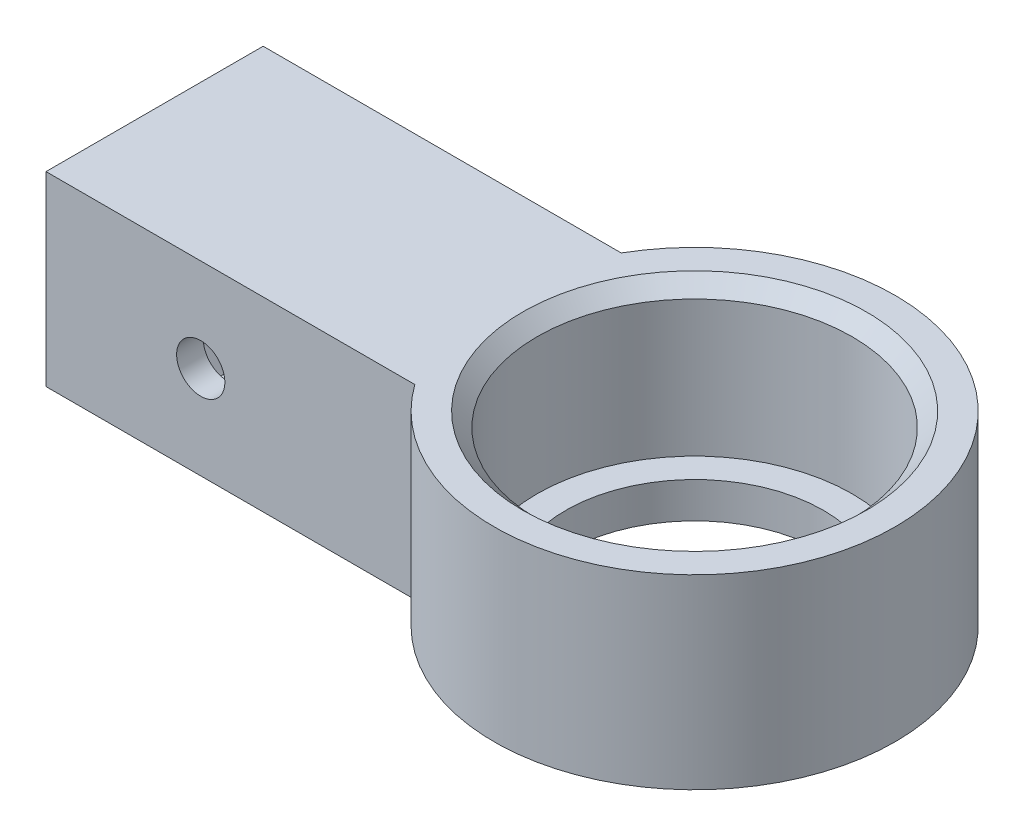
ISO-10303-21;
HEADER;
FILE_DESCRIPTION(('STEP AP214'),'2;1');
FILE_NAME('part.step','',(''),(''),'','','');
FILE_SCHEMA(('AUTOMOTIVE_DESIGN { 1 0 10303 214 1 1 1 1 }'));
ENDSEC;
DATA;
#1=APPLICATION_CONTEXT('core data for automotive mechanical design processes');
#2=APPLICATION_PROTOCOL_DEFINITION('international standard','automotive_design',2000,#1);
#3=PRODUCT_CONTEXT('',#1,'mechanical');
#4=PRODUCT('Part','Part','',(#3));
#5=PRODUCT_RELATED_PRODUCT_CATEGORY('part','',(#4));
#6=PRODUCT_DEFINITION_FORMATION('','',#4);
#7=PRODUCT_DEFINITION_CONTEXT('part definition',#1,'design');
#8=PRODUCT_DEFINITION('design','',#6,#7);
#9=PRODUCT_DEFINITION_SHAPE('','',#8);
#10=(LENGTH_UNIT() NAMED_UNIT(*) SI_UNIT(.MILLI.,.METRE.));
#11=(NAMED_UNIT(*) PLANE_ANGLE_UNIT() SI_UNIT($,.RADIAN.));
#12=(NAMED_UNIT(*) SI_UNIT($,.STERADIAN.) SOLID_ANGLE_UNIT());
#13=UNCERTAINTY_MEASURE_WITH_UNIT(LENGTH_MEASURE(1.E-05),#10,'distance_accuracy_value','');
#14=(GEOMETRIC_REPRESENTATION_CONTEXT(3) GLOBAL_UNCERTAINTY_ASSIGNED_CONTEXT((#13)) GLOBAL_UNIT_ASSIGNED_CONTEXT((#10,
#11,#12)) REPRESENTATION_CONTEXT('',''));
#15=CARTESIAN_POINT('',(0.,0.,0.));
#16=DIRECTION('',(0.,0.,1.));
#17=DIRECTION('',(1.,0.,0.));
#18=AXIS2_PLACEMENT_3D('',#15,#16,#17);
#19=CARTESIAN_POINT('',(0.,13.,0.));
#20=DIRECTION('',(0.,-1.,0.));
#21=DIRECTION('',(0.,0.,-1.));
#22=AXIS2_PLACEMENT_3D('',#19,#20,#21);
#23=CYLINDRICAL_SURFACE('',#22,11.);
#24=CARTESIAN_POINT('',(0.,12.,0.));
#25=DIRECTION('',(0.,1.,0.));
#26=DIRECTION('',(0.,0.,1.));
#27=AXIS2_PLACEMENT_3D('',#24,#25,#26);
#28=CIRCLE('',#27,11.);
#29=CARTESIAN_POINT('',(0.,12.,11.));
#30=VERTEX_POINT('',#29);
#31=EDGE_CURVE('E41',#30,#30,#28,.T.);
#32=ORIENTED_EDGE('',*,*,#31,.T.);
#33=EDGE_LOOP('',(#32));
#34=FACE_BOUND('',#33,.T.);
#35=CARTESIAN_POINT('',(0.,2.5,0.));
#36=DIRECTION('',(0.,-1.,0.));
#37=DIRECTION('',(0.,0.,-1.));
#38=AXIS2_PLACEMENT_3D('',#35,#36,#37);
#39=CIRCLE('',#38,11.);
#40=CARTESIAN_POINT('',(0.,2.5,-11.));
#41=VERTEX_POINT('',#40);
#42=EDGE_CURVE('E320',#41,#41,#39,.T.);
#43=ORIENTED_EDGE('',*,*,#42,.T.);
#44=EDGE_LOOP('',(#43));
#45=FACE_BOUND('',#44,.T.);
#46=ADVANCED_FACE('F33',(#34,#45),#23,.F.);
#47=CARTESIAN_POINT('',(0.,13.,0.));
#48=DIRECTION('',(0.,1.,0.));
#49=DIRECTION('',(0.,0.,1.));
#50=AXIS2_PLACEMENT_3D('',#47,#48,#49);
#51=PLANE('',#50);
#52=CARTESIAN_POINT('',(0.,13.,0.));
#53=DIRECTION('',(0.,1.,0.));
#54=DIRECTION('',(0.,0.,1.));
#55=AXIS2_PLACEMENT_3D('',#52,#53,#54);
#56=CIRCLE('',#55,12.);
#57=CARTESIAN_POINT('',(0.,13.,12.));
#58=VERTEX_POINT('',#57);
#59=EDGE_CURVE('E11',#58,#58,#56,.F.);
#60=ORIENTED_EDGE('',*,*,#59,.T.);
#61=EDGE_LOOP('',(#60));
#62=FACE_BOUND('',#61,.T.);
#63=CARTESIAN_POINT('',(0.,13.,0.));
#64=DIRECTION('',(0.,1.,0.));
#65=DIRECTION('',(0.,0.,1.));
#66=AXIS2_PLACEMENT_3D('',#63,#64,#65);
#67=CIRCLE('',#66,14.);
#68=CARTESIAN_POINT('',(-11.375302548228,13.,8.16103497947882));
#69=VERTEX_POINT('',#68);
#70=CARTESIAN_POINT('',(-12.1243556529821,13.,-7.));
#71=VERTEX_POINT('',#70);
#72=EDGE_CURVE('E222',#69,#71,#67,.T.);
#73=ORIENTED_EDGE('',*,*,#72,.T.);
#74=DIRECTION('',(-1.,0.,0.));
#75=VECTOR('',#74,1.);
#76=CARTESIAN_POINT('',(-12.1243556529821,13.,-7.));
#77=LINE('',#76,#75);
#78=CARTESIAN_POINT('',(-37.1243556529821,13.,-7.));
#79=VERTEX_POINT('',#78);
#80=EDGE_CURVE('E225',#71,#79,#77,.T.);
#81=ORIENTED_EDGE('',*,*,#80,.T.);
#82=DIRECTION('',(0.,0.,1.));
#83=VECTOR('',#82,1.);
#84=CARTESIAN_POINT('',(-37.1243556529821,13.,8.16103497947882));
#85=LINE('',#84,#83);
#86=CARTESIAN_POINT('',(-37.1243556529821,13.,8.16103497947882));
#87=VERTEX_POINT('',#86);
#88=EDGE_CURVE('E228',#79,#87,#85,.T.);
#89=ORIENTED_EDGE('',*,*,#88,.T.);
#90=DIRECTION('',(1.,0.,0.));
#91=VECTOR('',#90,1.);
#92=CARTESIAN_POINT('',(-37.1243556529821,13.,8.16103497947882));
#93=LINE('',#92,#91);
#94=EDGE_CURVE('E230',#87,#69,#93,.T.);
#95=ORIENTED_EDGE('',*,*,#94,.T.);
#96=EDGE_LOOP('',(#73,#81,#89,#95));
#97=FACE_BOUND('',#96,.T.);
#98=ADVANCED_FACE('F266',(#62,#97),#51,.T.);
#99=CARTESIAN_POINT('',(0.,0.,0.));
#100=DIRECTION('',(0.,1.,0.));
#101=DIRECTION('',(0.,0.,1.));
#102=AXIS2_PLACEMENT_3D('',#99,#100,#101);
#103=PLANE('',#102);
#104=CARTESIAN_POINT('',(0.,0.,0.));
#105=DIRECTION('',(0.,1.,0.));
#106=DIRECTION('',(0.,0.,1.));
#107=AXIS2_PLACEMENT_3D('',#104,#105,#106);
#108=CIRCLE('',#107,14.);
#109=CARTESIAN_POINT('',(-11.375302548228,0.,8.16103497947882));
#110=VERTEX_POINT('',#109);
#111=CARTESIAN_POINT('',(-12.1243556529821,0.,-7.));
#112=VERTEX_POINT('',#111);
#113=EDGE_CURVE('E216',#110,#112,#108,.T.);
#114=ORIENTED_EDGE('',*,*,#113,.F.);
#115=DIRECTION('',(1.,0.,0.));
#116=VECTOR('',#115,1.);
#117=CARTESIAN_POINT('',(-37.1243556529821,0.,8.16103497947882));
#118=LINE('',#117,#116);
#119=CARTESIAN_POINT('',(-37.1243556529821,0.,8.16103497947882));
#120=VERTEX_POINT('',#119);
#121=EDGE_CURVE('E226',#120,#110,#118,.T.);
#122=ORIENTED_EDGE('',*,*,#121,.F.);
#123=DIRECTION('',(0.,0.,1.));
#124=VECTOR('',#123,1.);
#125=CARTESIAN_POINT('',(-37.1243556529821,0.,8.16103497947882));
#126=LINE('',#125,#124);
#127=CARTESIAN_POINT('',(-37.1243556529821,0.,-7.));
#128=VERTEX_POINT('',#127);
#129=EDGE_CURVE('E237',#128,#120,#126,.T.);
#130=ORIENTED_EDGE('',*,*,#129,.F.);
#131=DIRECTION('',(-1.,0.,0.));
#132=VECTOR('',#131,1.);
#133=CARTESIAN_POINT('',(-12.1243556529821,0.,-7.));
#134=LINE('',#133,#132);
#135=EDGE_CURVE('E235',#112,#128,#134,.T.);
#136=ORIENTED_EDGE('',*,*,#135,.F.);
#137=EDGE_LOOP('',(#114,#122,#130,#136));
#138=FACE_BOUND('',#137,.T.);
#139=CARTESIAN_POINT('',(0.,0.,0.));
#140=DIRECTION('',(0.,-1.,0.));
#141=DIRECTION('',(0.,0.,-1.));
#142=AXIS2_PLACEMENT_3D('',#139,#140,#141);
#143=CIRCLE('',#142,9.);
#144=CARTESIAN_POINT('',(0.,0.,-9.));
#145=VERTEX_POINT('',#144);
#146=EDGE_CURVE('E315',#145,#145,#143,.T.);
#147=ORIENTED_EDGE('',*,*,#146,.F.);
#148=EDGE_LOOP('',(#147));
#149=FACE_BOUND('',#148,.T.);
#150=ADVANCED_FACE('F272',(#138,#149),#103,.F.);
#151=CARTESIAN_POINT('',(0.,13.,0.));
#152=DIRECTION('',(0.,-1.,0.));
#153=DIRECTION('',(0.,0.,-1.));
#154=AXIS2_PLACEMENT_3D('',#151,#152,#153);
#155=CYLINDRICAL_SURFACE('',#154,14.);
#156=ORIENTED_EDGE('',*,*,#113,.T.);
#157=DIRECTION('',(0.,-1.,0.));
#158=VECTOR('',#157,1.);
#159=CARTESIAN_POINT('',(-12.1243556529821,13.,-7.));
#160=LINE('',#159,#158);
#161=EDGE_CURVE('E248',#71,#112,#160,.T.);
#162=ORIENTED_EDGE('',*,*,#161,.F.);
#163=ORIENTED_EDGE('',*,*,#72,.F.);
#164=DIRECTION('',(0.,-1.,0.));
#165=VECTOR('',#164,1.);
#166=CARTESIAN_POINT('',(-11.375302548228,13.,8.16103497947882));
#167=LINE('',#166,#165);
#168=EDGE_CURVE('E232',#69,#110,#167,.T.);
#169=ORIENTED_EDGE('',*,*,#168,.T.);
#170=EDGE_LOOP('',(#156,#162,#163,#169));
#171=FACE_BOUND('',#170,.T.);
#172=ADVANCED_FACE('F281',(#171),#155,.T.);
#173=CARTESIAN_POINT('',(-12.1243556529821,13.,-7.));
#174=DIRECTION('',(0.,0.,1.));
#175=DIRECTION('',(1.,0.,0.));
#176=AXIS2_PLACEMENT_3D('',#173,#174,#175);
#177=PLANE('',#176);
#178=ORIENTED_EDGE('',*,*,#135,.T.);
#179=DIRECTION('',(0.,-1.,0.));
#180=VECTOR('',#179,1.);
#181=CARTESIAN_POINT('',(-37.1243556529821,13.,-7.));
#182=LINE('',#181,#180);
#183=EDGE_CURVE('E245',#79,#128,#182,.T.);
#184=ORIENTED_EDGE('',*,*,#183,.F.);
#185=ORIENTED_EDGE('',*,*,#80,.F.);
#186=ORIENTED_EDGE('',*,*,#161,.T.);
#187=EDGE_LOOP('',(#178,#184,#185,#186));
#188=FACE_BOUND('',#187,.T.);
#189=ADVANCED_FACE('F290',(#188),#177,.F.);
#190=CARTESIAN_POINT('',(-37.1243556529821,13.,8.16103497947882));
#191=DIRECTION('',(1.,0.,0.));
#192=DIRECTION('',(0.,0.,-1.));
#193=AXIS2_PLACEMENT_3D('',#190,#191,#192);
#194=PLANE('',#193);
#195=DIRECTION('',(0.,0.,1.));
#196=VECTOR('',#195,1.);
#197=CARTESIAN_POINT('',(-37.1243556529821,3.,3.5));
#198=LINE('',#197,#196);
#199=CARTESIAN_POINT('',(-37.1243556529821,3.,-3.5));
#200=VERTEX_POINT('',#199);
#201=CARTESIAN_POINT('',(-37.1243556529821,3.,3.5));
#202=VERTEX_POINT('',#201);
#203=EDGE_CURVE('E206',#200,#202,#198,.T.);
#204=ORIENTED_EDGE('',*,*,#203,.F.);
#205=DIRECTION('',(0.,-1.,0.));
#206=VECTOR('',#205,1.);
#207=CARTESIAN_POINT('',(-37.1243556529821,3.,-3.5));
#208=LINE('',#207,#206);
#209=CARTESIAN_POINT('',(-37.1243556529821,10.,-3.5));
#210=VERTEX_POINT('',#209);
#211=EDGE_CURVE('E56',#210,#200,#208,.T.);
#212=ORIENTED_EDGE('',*,*,#211,.F.);
#213=DIRECTION('',(0.,0.,-1.));
#214=VECTOR('',#213,1.);
#215=CARTESIAN_POINT('',(-37.1243556529821,10.,3.5));
#216=LINE('',#215,#214);
#217=CARTESIAN_POINT('',(-37.1243556529821,10.,3.5));
#218=VERTEX_POINT('',#217);
#219=EDGE_CURVE('E195',#218,#210,#216,.T.);
#220=ORIENTED_EDGE('',*,*,#219,.F.);
#221=DIRECTION('',(0.,1.,0.));
#222=VECTOR('',#221,1.);
#223=CARTESIAN_POINT('',(-37.1243556529821,3.,3.5));
#224=LINE('',#223,#222);
#225=EDGE_CURVE('E209',#202,#218,#224,.T.);
#226=ORIENTED_EDGE('',*,*,#225,.F.);
#227=EDGE_LOOP('',(#204,#212,#220,#226));
#228=FACE_BOUND('',#227,.T.);
#229=ORIENTED_EDGE('',*,*,#129,.T.);
#230=DIRECTION('',(0.,-1.,0.));
#231=VECTOR('',#230,1.);
#232=CARTESIAN_POINT('',(-37.1243556529821,13.,8.16103497947882));
#233=LINE('',#232,#231);
#234=EDGE_CURVE('E242',#87,#120,#233,.T.);
#235=ORIENTED_EDGE('',*,*,#234,.F.);
#236=ORIENTED_EDGE('',*,*,#88,.F.);
#237=ORIENTED_EDGE('',*,*,#183,.T.);
#238=EDGE_LOOP('',(#229,#235,#236,#237));
#239=FACE_BOUND('',#238,.T.);
#240=ADVANCED_FACE('F286',(#228,#239),#194,.F.);
#241=CARTESIAN_POINT('',(-37.1243556529821,13.,8.16103497947882));
#242=DIRECTION('',(0.,0.,-1.));
#243=DIRECTION('',(-1.,0.,0.));
#244=AXIS2_PLACEMENT_3D('',#241,#242,#243);
#245=PLANE('',#244);
#246=CARTESIAN_POINT('',(-26.3212409424091,6.5,8.16103497947882));
#247=DIRECTION('',(0.,0.,-1.));
#248=DIRECTION('',(-1.,0.,0.));
#249=AXIS2_PLACEMENT_3D('',#246,#247,#248);
#250=CIRCLE('',#249,1.68366195753649);
#251=CARTESIAN_POINT('',(-28.0049028999456,6.5,8.16103497947882));
#252=VERTEX_POINT('',#251);
#253=EDGE_CURVE('E161',#252,#252,#250,.T.);
#254=ORIENTED_EDGE('',*,*,#253,.T.);
#255=EDGE_LOOP('',(#254));
#256=FACE_BOUND('',#255,.T.);
#257=ORIENTED_EDGE('',*,*,#121,.T.);
#258=ORIENTED_EDGE('',*,*,#168,.F.);
#259=ORIENTED_EDGE('',*,*,#94,.F.);
#260=ORIENTED_EDGE('',*,*,#234,.T.);
#261=EDGE_LOOP('',(#257,#258,#259,#260));
#262=FACE_BOUND('',#261,.T.);
#263=ADVANCED_FACE('F283',(#256,#262),#245,.F.);
#264=CARTESIAN_POINT('',(-11.1243556529821,3.,-3.5));
#265=DIRECTION('',(0.,0.,-1.));
#266=DIRECTION('',(-1.,0.,0.));
#267=AXIS2_PLACEMENT_3D('',#264,#265,#266);
#268=PLANE('',#267);
#269=ORIENTED_EDGE('',*,*,#211,.T.);
#270=DIRECTION('',(-1.,0.,0.));
#271=VECTOR('',#270,1.);
#272=CARTESIAN_POINT('',(-11.1243556529821,3.,-3.5));
#273=LINE('',#272,#271);
#274=CARTESIAN_POINT('',(-11.1243556529821,3.,-3.5));
#275=VERTEX_POINT('',#274);
#276=EDGE_CURVE('E204',#275,#200,#273,.T.);
#277=ORIENTED_EDGE('',*,*,#276,.F.);
#278=DIRECTION('',(0.,-1.,0.));
#279=VECTOR('',#278,1.);
#280=CARTESIAN_POINT('',(-11.1243556529821,3.,-3.5));
#281=LINE('',#280,#279);
#282=CARTESIAN_POINT('',(-11.1243556529821,10.,-3.5));
#283=VERTEX_POINT('',#282);
#284=EDGE_CURVE('E191',#283,#275,#281,.T.);
#285=ORIENTED_EDGE('',*,*,#284,.F.);
#286=DIRECTION('',(-1.,0.,0.));
#287=VECTOR('',#286,1.);
#288=CARTESIAN_POINT('',(-11.1243556529821,10.,-3.5));
#289=LINE('',#288,#287);
#290=EDGE_CURVE('E214',#283,#210,#289,.T.);
#291=ORIENTED_EDGE('',*,*,#290,.T.);
#292=EDGE_LOOP('',(#269,#277,#285,#291));
#293=FACE_BOUND('',#292,.T.);
#294=ADVANCED_FACE('F276',(#293),#268,.F.);
#295=CARTESIAN_POINT('',(-11.1243556529821,10.,3.5));
#296=DIRECTION('',(0.,1.,0.));
#297=DIRECTION('',(0.,0.,1.));
#298=AXIS2_PLACEMENT_3D('',#295,#296,#297);
#299=PLANE('',#298);
#300=ORIENTED_EDGE('',*,*,#219,.T.);
#301=ORIENTED_EDGE('',*,*,#290,.F.);
#302=DIRECTION('',(0.,0.,-1.));
#303=VECTOR('',#302,1.);
#304=CARTESIAN_POINT('',(-11.1243556529821,10.,3.5));
#305=LINE('',#304,#303);
#306=CARTESIAN_POINT('',(-11.1243556529821,10.,3.5));
#307=VERTEX_POINT('',#306);
#308=EDGE_CURVE('E201',#307,#283,#305,.T.);
#309=ORIENTED_EDGE('',*,*,#308,.F.);
#310=DIRECTION('',(-1.,0.,0.));
#311=VECTOR('',#310,1.);
#312=CARTESIAN_POINT('',(-11.1243556529821,10.,3.5));
#313=LINE('',#312,#311);
#314=EDGE_CURVE('E217',#307,#218,#313,.T.);
#315=ORIENTED_EDGE('',*,*,#314,.T.);
#316=EDGE_LOOP('',(#300,#301,#309,#315));
#317=FACE_BOUND('',#316,.T.);
#318=ADVANCED_FACE('F369',(#317),#299,.F.);
#319=CARTESIAN_POINT('',(-11.1243556529821,3.,3.5));
#320=DIRECTION('',(0.,0.,1.));
#321=DIRECTION('',(1.,0.,0.));
#322=AXIS2_PLACEMENT_3D('',#319,#320,#321);
#323=PLANE('',#322);
#324=DIRECTION('',(-0.5,-0.866025403784439,0.));
#325=VECTOR('',#324,1.);
#326=CARTESIAN_POINT('',(-23.1458144618662,6.5,3.5));
#327=LINE('',#326,#325);
#328=CARTESIAN_POINT('',(-23.1458144618662,6.5,3.5));
#329=VERTEX_POINT('',#328);
#330=CARTESIAN_POINT('',(-24.7335277021377,3.74999999999999,3.5));
#331=VERTEX_POINT('',#330);
#332=EDGE_CURVE('E172',#329,#331,#327,.T.);
#333=ORIENTED_EDGE('',*,*,#332,.F.);
#334=DIRECTION('',(0.5,-0.866025403784439,0.));
#335=VECTOR('',#334,1.);
#336=CARTESIAN_POINT('',(-24.7335277021377,9.25,3.5));
#337=LINE('',#336,#335);
#338=CARTESIAN_POINT('',(-24.7335277021377,9.25,3.5));
#339=VERTEX_POINT('',#338);
#340=EDGE_CURVE('E48',#339,#329,#337,.T.);
#341=ORIENTED_EDGE('',*,*,#340,.F.);
#342=DIRECTION('',(1.,0.,0.));
#343=VECTOR('',#342,1.);
#344=CARTESIAN_POINT('',(-27.9089541826806,9.25,3.5));
#345=LINE('',#344,#343);
#346=CARTESIAN_POINT('',(-27.9089541826806,9.25,3.5));
#347=VERTEX_POINT('',#346);
#348=EDGE_CURVE('E155',#347,#339,#345,.T.);
#349=ORIENTED_EDGE('',*,*,#348,.F.);
#350=DIRECTION('',(0.5,0.866025403784438,0.));
#351=VECTOR('',#350,1.);
#352=CARTESIAN_POINT('',(-29.4966674229521,6.5,3.5));
#353=LINE('',#352,#351);
#354=CARTESIAN_POINT('',(-29.4966674229521,6.5,3.5));
#355=VERTEX_POINT('',#354);
#356=EDGE_CURVE('E158',#355,#347,#353,.T.);
#357=ORIENTED_EDGE('',*,*,#356,.F.);
#358=DIRECTION('',(-0.499999999999999,0.866025403784439,0.));
#359=VECTOR('',#358,1.);
#360=CARTESIAN_POINT('',(-27.9089541826806,3.74999999999999,3.5));
#361=LINE('',#360,#359);
#362=CARTESIAN_POINT('',(-27.9089541826806,3.74999999999999,3.5));
#363=VERTEX_POINT('',#362);
#364=EDGE_CURVE('E177',#363,#355,#361,.T.);
#365=ORIENTED_EDGE('',*,*,#364,.F.);
#366=DIRECTION('',(-1.,0.,0.));
#367=VECTOR('',#366,1.);
#368=CARTESIAN_POINT('',(-24.7335277021377,3.74999999999999,3.5));
#369=LINE('',#368,#367);
#370=EDGE_CURVE('E174',#331,#363,#369,.T.);
#371=ORIENTED_EDGE('',*,*,#370,.F.);
#372=EDGE_LOOP('',(#333,#341,#349,#357,#365,#371));
#373=FACE_BOUND('',#372,.T.);
#374=ORIENTED_EDGE('',*,*,#225,.T.);
#375=ORIENTED_EDGE('',*,*,#314,.F.);
#376=DIRECTION('',(0.,1.,0.));
#377=VECTOR('',#376,1.);
#378=CARTESIAN_POINT('',(-11.1243556529821,3.,3.5));
#379=LINE('',#378,#377);
#380=CARTESIAN_POINT('',(-11.1243556529821,3.,3.5));
#381=VERTEX_POINT('',#380);
#382=EDGE_CURVE('E198',#381,#307,#379,.T.);
#383=ORIENTED_EDGE('',*,*,#382,.F.);
#384=DIRECTION('',(-1.,0.,0.));
#385=VECTOR('',#384,1.);
#386=CARTESIAN_POINT('',(-11.1243556529821,3.,3.5));
#387=LINE('',#386,#385);
#388=EDGE_CURVE('E219',#381,#202,#387,.T.);
#389=ORIENTED_EDGE('',*,*,#388,.T.);
#390=EDGE_LOOP('',(#374,#375,#383,#389));
#391=FACE_BOUND('',#390,.T.);
#392=ADVANCED_FACE('F372',(#373,#391),#323,.F.);
#393=CARTESIAN_POINT('',(-11.1243556529821,3.,3.5));
#394=DIRECTION('',(0.,-1.,0.));
#395=DIRECTION('',(0.,0.,-1.));
#396=AXIS2_PLACEMENT_3D('',#393,#394,#395);
#397=PLANE('',#396);
#398=ORIENTED_EDGE('',*,*,#203,.T.);
#399=ORIENTED_EDGE('',*,*,#388,.F.);
#400=DIRECTION('',(0.,0.,1.));
#401=VECTOR('',#400,1.);
#402=CARTESIAN_POINT('',(-11.1243556529821,3.,3.5));
#403=LINE('',#402,#401);
#404=EDGE_CURVE('E194',#275,#381,#403,.T.);
#405=ORIENTED_EDGE('',*,*,#404,.F.);
#406=ORIENTED_EDGE('',*,*,#276,.T.);
#407=EDGE_LOOP('',(#398,#399,#405,#406));
#408=FACE_BOUND('',#407,.T.);
#409=ADVANCED_FACE('F367',(#408),#397,.F.);
#410=CARTESIAN_POINT('',(-11.1243556529821,0.,0.));
#411=DIRECTION('',(-1.,0.,0.));
#412=DIRECTION('',(0.,0.,1.));
#413=AXIS2_PLACEMENT_3D('',#410,#411,#412);
#414=PLANE('',#413);
#415=ORIENTED_EDGE('',*,*,#284,.T.);
#416=ORIENTED_EDGE('',*,*,#404,.T.);
#417=ORIENTED_EDGE('',*,*,#382,.T.);
#418=ORIENTED_EDGE('',*,*,#308,.T.);
#419=EDGE_LOOP('',(#415,#416,#417,#418));
#420=FACE_BOUND('',#419,.T.);
#421=ADVANCED_FACE('F364',(#420),#414,.T.);
#422=CARTESIAN_POINT('',(-24.7335277021377,9.25,6.3));
#423=DIRECTION('',(0.866025403784439,0.5,0.));
#424=DIRECTION('',(-0.5,0.866025403784439,0.));
#425=AXIS2_PLACEMENT_3D('',#422,#423,#424);
#426=PLANE('',#425);
#427=ORIENTED_EDGE('',*,*,#340,.T.);
#428=DIRECTION('',(0.,0.,-1.));
#429=VECTOR('',#428,1.);
#430=CARTESIAN_POINT('',(-23.1458144618662,6.5,6.3));
#431=LINE('',#430,#429);
#432=CARTESIAN_POINT('',(-23.1458144618662,6.5,6.3));
#433=VERTEX_POINT('',#432);
#434=EDGE_CURVE('E132',#433,#329,#431,.T.);
#435=ORIENTED_EDGE('',*,*,#434,.F.);
#436=DIRECTION('',(0.5,-0.866025403784439,0.));
#437=VECTOR('',#436,1.);
#438=CARTESIAN_POINT('',(-24.7335277021377,9.25,6.3));
#439=LINE('',#438,#437);
#440=CARTESIAN_POINT('',(-24.7335277021377,9.25,6.3));
#441=VERTEX_POINT('',#440);
#442=EDGE_CURVE('E136',#441,#433,#439,.T.);
#443=ORIENTED_EDGE('',*,*,#442,.F.);
#444=DIRECTION('',(0.,0.,-1.));
#445=VECTOR('',#444,1.);
#446=CARTESIAN_POINT('',(-24.7335277021377,9.25,6.3));
#447=LINE('',#446,#445);
#448=EDGE_CURVE('E182',#441,#339,#447,.T.);
#449=ORIENTED_EDGE('',*,*,#448,.T.);
#450=EDGE_LOOP('',(#427,#435,#443,#449));
#451=FACE_BOUND('',#450,.T.);
#452=ADVANCED_FACE('F134',(#451),#426,.F.);
#453=CARTESIAN_POINT('',(-27.9089541826806,9.25,6.3));
#454=DIRECTION('',(0.,1.,0.));
#455=DIRECTION('',(0.,0.,1.));
#456=AXIS2_PLACEMENT_3D('',#453,#454,#455);
#457=PLANE('',#456);
#458=ORIENTED_EDGE('',*,*,#348,.T.);
#459=ORIENTED_EDGE('',*,*,#448,.F.);
#460=DIRECTION('',(1.,0.,0.));
#461=VECTOR('',#460,1.);
#462=CARTESIAN_POINT('',(-27.9089541826806,9.25,6.3));
#463=LINE('',#462,#461);
#464=CARTESIAN_POINT('',(-27.9089541826806,9.25,6.3));
#465=VERTEX_POINT('',#464);
#466=EDGE_CURVE('E142',#465,#441,#463,.T.);
#467=ORIENTED_EDGE('',*,*,#466,.F.);
#468=DIRECTION('',(0.,0.,-1.));
#469=VECTOR('',#468,1.);
#470=CARTESIAN_POINT('',(-27.9089541826806,9.25,6.3));
#471=LINE('',#470,#469);
#472=EDGE_CURVE('E184',#465,#347,#471,.T.);
#473=ORIENTED_EDGE('',*,*,#472,.T.);
#474=EDGE_LOOP('',(#458,#459,#467,#473));
#475=FACE_BOUND('',#474,.T.);
#476=ADVANCED_FACE('F344',(#475),#457,.F.);
#477=CARTESIAN_POINT('',(-29.4966674229521,6.5,6.3));
#478=DIRECTION('',(-0.866025403784439,0.5,0.));
#479=DIRECTION('',(-0.5,-0.866025403784439,0.));
#480=AXIS2_PLACEMENT_3D('',#477,#478,#479);
#481=PLANE('',#480);
#482=ORIENTED_EDGE('',*,*,#356,.T.);
#483=ORIENTED_EDGE('',*,*,#472,.F.);
#484=DIRECTION('',(0.5,0.866025403784438,0.));
#485=VECTOR('',#484,1.);
#486=CARTESIAN_POINT('',(-29.4966674229521,6.5,6.3));
#487=LINE('',#486,#485);
#488=CARTESIAN_POINT('',(-29.4966674229521,6.5,6.3));
#489=VERTEX_POINT('',#488);
#490=EDGE_CURVE('E168',#489,#465,#487,.T.);
#491=ORIENTED_EDGE('',*,*,#490,.F.);
#492=DIRECTION('',(0.,0.,-1.));
#493=VECTOR('',#492,1.);
#494=CARTESIAN_POINT('',(-29.4966674229521,6.5,6.3));
#495=LINE('',#494,#493);
#496=EDGE_CURVE('E186',#489,#355,#495,.T.);
#497=ORIENTED_EDGE('',*,*,#496,.T.);
#498=EDGE_LOOP('',(#482,#483,#491,#497));
#499=FACE_BOUND('',#498,.T.);
#500=ADVANCED_FACE('F347',(#499),#481,.F.);
#501=CARTESIAN_POINT('',(-27.9089541826806,3.74999999999999,6.3));
#502=DIRECTION('',(-0.866025403784439,-0.499999999999999,0.));
#503=DIRECTION('',(0.499999999999999,-0.866025403784439,0.));
#504=AXIS2_PLACEMENT_3D('',#501,#502,#503);
#505=PLANE('',#504);
#506=ORIENTED_EDGE('',*,*,#364,.T.);
#507=ORIENTED_EDGE('',*,*,#496,.F.);
#508=DIRECTION('',(-0.499999999999999,0.866025403784439,0.));
#509=VECTOR('',#508,1.);
#510=CARTESIAN_POINT('',(-27.9089541826806,3.74999999999999,6.3));
#511=LINE('',#510,#509);
#512=CARTESIAN_POINT('',(-27.9089541826806,3.74999999999999,6.3));
#513=VERTEX_POINT('',#512);
#514=EDGE_CURVE('E165',#513,#489,#511,.T.);
#515=ORIENTED_EDGE('',*,*,#514,.F.);
#516=DIRECTION('',(0.,0.,-1.));
#517=VECTOR('',#516,1.);
#518=CARTESIAN_POINT('',(-27.9089541826806,3.74999999999999,6.3));
#519=LINE('',#518,#517);
#520=EDGE_CURVE('E188',#513,#363,#519,.T.);
#521=ORIENTED_EDGE('',*,*,#520,.T.);
#522=EDGE_LOOP('',(#506,#507,#515,#521));
#523=FACE_BOUND('',#522,.T.);
#524=ADVANCED_FACE('F351',(#523),#505,.F.);
#525=CARTESIAN_POINT('',(-24.7335277021377,3.74999999999999,6.3));
#526=DIRECTION('',(0.,-1.,0.));
#527=DIRECTION('',(1.,0.,0.));
#528=AXIS2_PLACEMENT_3D('',#525,#526,#527);
#529=PLANE('',#528);
#530=ORIENTED_EDGE('',*,*,#370,.T.);
#531=ORIENTED_EDGE('',*,*,#520,.F.);
#532=DIRECTION('',(-1.,0.,0.));
#533=VECTOR('',#532,1.);
#534=CARTESIAN_POINT('',(-24.7335277021377,3.74999999999999,6.3));
#535=LINE('',#534,#533);
#536=CARTESIAN_POINT('',(-24.7335277021377,3.74999999999999,6.3));
#537=VERTEX_POINT('',#536);
#538=EDGE_CURVE('E150',#537,#513,#535,.T.);
#539=ORIENTED_EDGE('',*,*,#538,.F.);
#540=DIRECTION('',(0.,0.,-1.));
#541=VECTOR('',#540,1.);
#542=CARTESIAN_POINT('',(-24.7335277021377,3.74999999999999,6.3));
#543=LINE('',#542,#541);
#544=EDGE_CURVE('E141',#537,#331,#543,.T.);
#545=ORIENTED_EDGE('',*,*,#544,.T.);
#546=EDGE_LOOP('',(#530,#531,#539,#545));
#547=FACE_BOUND('',#546,.T.);
#548=ADVANCED_FACE('F355',(#547),#529,.F.);
#549=CARTESIAN_POINT('',(-23.1458144618662,6.5,6.3));
#550=DIRECTION('',(0.866025403784439,-0.5,0.));
#551=DIRECTION('',(0.5,0.866025403784439,0.));
#552=AXIS2_PLACEMENT_3D('',#549,#550,#551);
#553=PLANE('',#552);
#554=ORIENTED_EDGE('',*,*,#332,.T.);
#555=ORIENTED_EDGE('',*,*,#544,.F.);
#556=DIRECTION('',(-0.5,-0.866025403784439,0.));
#557=VECTOR('',#556,1.);
#558=CARTESIAN_POINT('',(-23.1458144618662,6.5,6.3));
#559=LINE('',#558,#557);
#560=EDGE_CURVE('E145',#433,#537,#559,.T.);
#561=ORIENTED_EDGE('',*,*,#560,.F.);
#562=ORIENTED_EDGE('',*,*,#434,.T.);
#563=EDGE_LOOP('',(#554,#555,#561,#562));
#564=FACE_BOUND('',#563,.T.);
#565=ADVANCED_FACE('F146',(#564),#553,.F.);
#566=CARTESIAN_POINT('',(0.,0.,6.3));
#567=DIRECTION('',(0.,0.,-1.));
#568=DIRECTION('',(-1.,0.,0.));
#569=AXIS2_PLACEMENT_3D('',#566,#567,#568);
#570=PLANE('',#569);
#571=CARTESIAN_POINT('',(-26.3212409424091,6.5,6.3));
#572=DIRECTION('',(0.,0.,-1.));
#573=DIRECTION('',(-1.,0.,0.));
#574=AXIS2_PLACEMENT_3D('',#571,#572,#573);
#575=CIRCLE('',#574,1.68366195753649);
#576=CARTESIAN_POINT('',(-28.0049028999456,6.5,6.3));
#577=VERTEX_POINT('',#576);
#578=EDGE_CURVE('E324',#577,#577,#575,.T.);
#579=ORIENTED_EDGE('',*,*,#578,.F.);
#580=EDGE_LOOP('',(#579));
#581=FACE_BOUND('',#580,.T.);
#582=ORIENTED_EDGE('',*,*,#442,.T.);
#583=ORIENTED_EDGE('',*,*,#560,.T.);
#584=ORIENTED_EDGE('',*,*,#538,.T.);
#585=ORIENTED_EDGE('',*,*,#514,.T.);
#586=ORIENTED_EDGE('',*,*,#490,.T.);
#587=ORIENTED_EDGE('',*,*,#466,.T.);
#588=EDGE_LOOP('',(#582,#583,#584,#585,#586,#587));
#589=FACE_BOUND('',#588,.T.);
#590=ADVANCED_FACE('F152',(#581,#589),#570,.T.);
#591=CARTESIAN_POINT('',(-26.3212409424091,6.5,9.1));
#592=DIRECTION('',(0.,0.,-1.));
#593=DIRECTION('',(-1.,0.,0.));
#594=AXIS2_PLACEMENT_3D('',#591,#592,#593);
#595=CYLINDRICAL_SURFACE('',#594,1.68366195753649);
#596=ORIENTED_EDGE('',*,*,#578,.T.);
#597=EDGE_LOOP('',(#596));
#598=FACE_BOUND('',#597,.T.);
#599=ORIENTED_EDGE('',*,*,#253,.F.);
#600=EDGE_LOOP('',(#599));
#601=FACE_BOUND('',#600,.T.);
#602=ADVANCED_FACE('F331',(#598,#601),#595,.F.);
#603=CARTESIAN_POINT('',(0.,2.5,0.));
#604=DIRECTION('',(0.,-1.,0.));
#605=DIRECTION('',(0.,0.,-1.));
#606=AXIS2_PLACEMENT_3D('',#603,#604,#605);
#607=PLANE('',#606);
#608=CARTESIAN_POINT('',(0.,2.5,0.));
#609=DIRECTION('',(0.,-1.,0.));
#610=DIRECTION('',(0.,0.,-1.));
#611=AXIS2_PLACEMENT_3D('',#608,#609,#610);
#612=CIRCLE('',#611,9.);
#613=CARTESIAN_POINT('',(0.,2.5,-9.));
#614=VERTEX_POINT('',#613);
#615=EDGE_CURVE('E317',#614,#614,#612,.T.);
#616=ORIENTED_EDGE('',*,*,#615,.T.);
#617=EDGE_LOOP('',(#616));
#618=FACE_BOUND('',#617,.T.);
#619=ORIENTED_EDGE('',*,*,#42,.F.);
#620=EDGE_LOOP('',(#619));
#621=FACE_BOUND('',#620,.T.);
#622=ADVANCED_FACE('F261',(#618,#621),#607,.F.);
#623=CARTESIAN_POINT('',(0.,2.5,0.));
#624=DIRECTION('',(0.,-1.,0.));
#625=DIRECTION('',(0.,0.,-1.));
#626=AXIS2_PLACEMENT_3D('',#623,#624,#625);
#627=CYLINDRICAL_SURFACE('',#626,9.);
#628=ORIENTED_EDGE('',*,*,#615,.F.);
#629=EDGE_LOOP('',(#628));
#630=FACE_BOUND('',#629,.T.);
#631=ORIENTED_EDGE('',*,*,#146,.T.);
#632=EDGE_LOOP('',(#631));
#633=FACE_BOUND('',#632,.T.);
#634=ADVANCED_FACE('F256',(#630,#633),#627,.F.);
#635=CARTESIAN_POINT('',(0.,12.,0.));
#636=DIRECTION('',(0.,1.,0.));
#637=DIRECTION('',(0.,0.,1.));
#638=AXIS2_PLACEMENT_3D('',#635,#636,#637);
#639=CONICAL_SURFACE('',#638,11.,0.78539816339745);
#640=ORIENTED_EDGE('',*,*,#59,.F.);
#641=EDGE_LOOP('',(#640));
#642=FACE_BOUND('',#641,.T.);
#643=ORIENTED_EDGE('',*,*,#31,.F.);
#644=EDGE_LOOP('',(#643));
#645=FACE_BOUND('',#644,.T.);
#646=ADVANCED_FACE('F35',(#642,#645),#639,.F.);
#647=CLOSED_SHELL('',(#46,#98,#150,#172,#189,#240,#263,#294,#318,#392,#409,#421,#452,#476,#500,
#524,#548,#565,#590,#602,#622,#634,#646));
#648=MANIFOLD_SOLID_BREP('B2',#647);
#649=ADVANCED_BREP_SHAPE_REPRESENTATION('',(#18,#648),#14);
#650=SHAPE_DEFINITION_REPRESENTATION(#9,#649);
ENDSEC;
END-ISO-10303-21;
